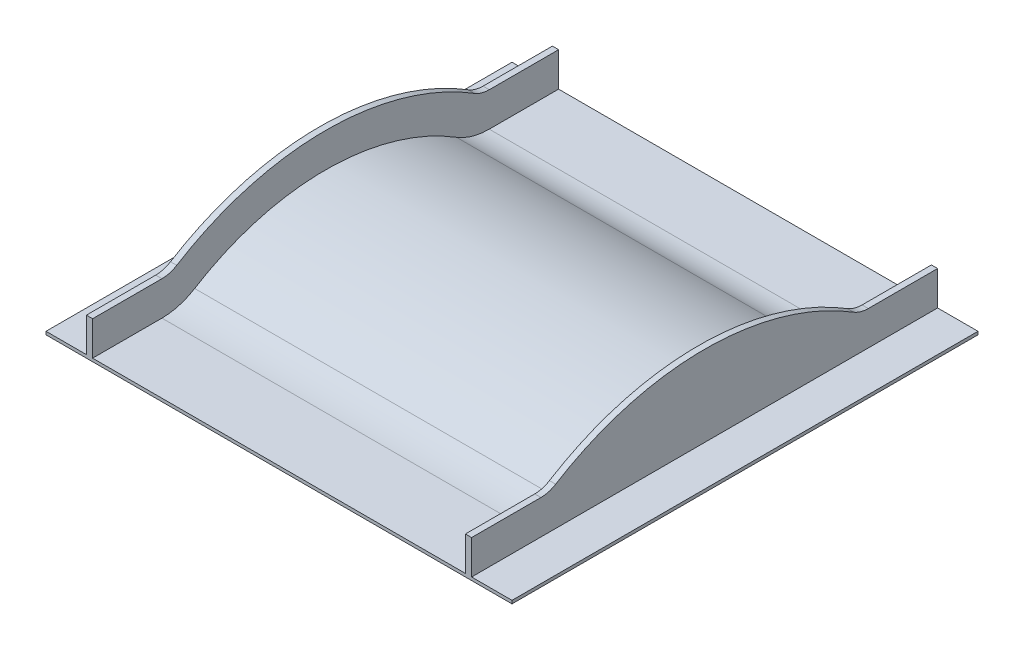
ISO-10303-21;
HEADER;
FILE_DESCRIPTION(('STEP AP214'),'2;1');
FILE_NAME('part.step','',(''),(''),'','','');
FILE_SCHEMA(('AUTOMOTIVE_DESIGN { 1 0 10303 214 1 1 1 1 }'));
ENDSEC;
DATA;
#1=APPLICATION_CONTEXT('core data for automotive mechanical design processes');
#2=APPLICATION_PROTOCOL_DEFINITION('international standard','automotive_design',2000,#1);
#3=PRODUCT_CONTEXT('',#1,'mechanical');
#4=PRODUCT('Part','Part','',(#3));
#5=PRODUCT_RELATED_PRODUCT_CATEGORY('part','',(#4));
#6=PRODUCT_DEFINITION_FORMATION('','',#4);
#7=PRODUCT_DEFINITION_CONTEXT('part definition',#1,'design');
#8=PRODUCT_DEFINITION('design','',#6,#7);
#9=PRODUCT_DEFINITION_SHAPE('','',#8);
#10=(LENGTH_UNIT() NAMED_UNIT(*) SI_UNIT(.MILLI.,.METRE.));
#11=(NAMED_UNIT(*) PLANE_ANGLE_UNIT() SI_UNIT($,.RADIAN.));
#12=(NAMED_UNIT(*) SI_UNIT($,.STERADIAN.) SOLID_ANGLE_UNIT());
#13=UNCERTAINTY_MEASURE_WITH_UNIT(LENGTH_MEASURE(1.E-05),#10,'distance_accuracy_value','');
#14=(GEOMETRIC_REPRESENTATION_CONTEXT(3) GLOBAL_UNCERTAINTY_ASSIGNED_CONTEXT((#13)) GLOBAL_UNIT_ASSIGNED_CONTEXT((#10,
#11,#12)) REPRESENTATION_CONTEXT('',''));
#15=CARTESIAN_POINT('',(0.,0.,0.));
#16=DIRECTION('',(0.,0.,1.));
#17=DIRECTION('',(1.,0.,0.));
#18=AXIS2_PLACEMENT_3D('',#15,#16,#17);
#19=CARTESIAN_POINT('',(0.,10.,0.));
#20=DIRECTION('',(0.,1.,0.));
#21=DIRECTION('',(0.,0.,1.));
#22=AXIS2_PLACEMENT_3D('',#19,#20,#21);
#23=PLANE('',#22);
#24=DIRECTION('',(1.,0.,0.));
#25=VECTOR('',#24,1.);
#26=CARTESIAN_POINT('',(-750.,10.,750.));
#27=LINE('',#26,#25);
#28=CARTESIAN_POINT('',(-600.,10.,750.));
#29=VERTEX_POINT('',#28);
#30=CARTESIAN_POINT('',(600.,10.,750.));
#31=VERTEX_POINT('',#30);
#32=EDGE_CURVE('E367',#29,#31,#27,.T.);
#33=ORIENTED_EDGE('',*,*,#32,.T.);
#34=DIRECTION('',(0.,0.,1.));
#35=VECTOR('',#34,1.);
#36=CARTESIAN_POINT('',(600.,10.,1.1470400727364E-13));
#37=LINE('',#36,#35);
#38=CARTESIAN_POINT('',(600.,10.,526.782687642637));
#39=VERTEX_POINT('',#38);
#40=EDGE_CURVE('E55',#39,#31,#37,.T.);
#41=ORIENTED_EDGE('',*,*,#40,.F.);
#42=DIRECTION('',(-1.,0.,0.));
#43=VECTOR('',#42,1.);
#44=CARTESIAN_POINT('',(1814.18983268964,10.,526.782687642637));
#45=LINE('',#44,#43);
#46=CARTESIAN_POINT('',(-600.,10.,526.782687642637));
#47=VERTEX_POINT('',#46);
#48=EDGE_CURVE('E345',#39,#47,#45,.T.);
#49=ORIENTED_EDGE('',*,*,#48,.T.);
#50=DIRECTION('',(0.,0.,1.));
#51=VECTOR('',#50,1.);
#52=CARTESIAN_POINT('',(-600.,10.,1.1470400727364E-13));
#53=LINE('',#52,#51);
#54=EDGE_CURVE('E290',#47,#29,#53,.T.);
#55=ORIENTED_EDGE('',*,*,#54,.T.);
#56=EDGE_LOOP('',(#33,#41,#49,#55));
#57=FACE_BOUND('',#56,.T.);
#58=ADVANCED_FACE('F40',(#57),#23,.T.);
#59=DIRECTION('',(-1.,0.,0.));
#60=VECTOR('',#59,1.);
#61=CARTESIAN_POINT('',(1814.18983268964,10.0000000000014,-526.782687642637));
#62=LINE('',#61,#60);
#63=CARTESIAN_POINT('',(600.,10.0000000000014,-526.782687642637));
#64=VERTEX_POINT('',#63);
#65=CARTESIAN_POINT('',(-600.,10.,-526.782687642636));
#66=VERTEX_POINT('',#65);
#67=EDGE_CURVE('E343',#64,#66,#62,.T.);
#68=ORIENTED_EDGE('',*,*,#67,.F.);
#69=DIRECTION('',(0.,0.,1.));
#70=VECTOR('',#69,1.);
#71=CARTESIAN_POINT('',(600.,10.,1.1470400727364E-13));
#72=LINE('',#71,#70);
#73=CARTESIAN_POINT('',(600.,10.,-750.));
#74=VERTEX_POINT('',#73);
#75=EDGE_CURVE('E222',#74,#64,#72,.T.);
#76=ORIENTED_EDGE('',*,*,#75,.F.);
#77=DIRECTION('',(-1.,0.,0.));
#78=VECTOR('',#77,1.);
#79=CARTESIAN_POINT('',(-750.,10.,-750.));
#80=LINE('',#79,#78);
#81=CARTESIAN_POINT('',(-600.,10.,-750.));
#82=VERTEX_POINT('',#81);
#83=EDGE_CURVE('E219',#74,#82,#80,.T.);
#84=ORIENTED_EDGE('',*,*,#83,.T.);
#85=DIRECTION('',(0.,0.,1.));
#86=VECTOR('',#85,1.);
#87=CARTESIAN_POINT('',(-600.,10.,1.1470400727364E-13));
#88=LINE('',#87,#86);
#89=EDGE_CURVE('E277',#82,#66,#88,.T.);
#90=ORIENTED_EDGE('',*,*,#89,.T.);
#91=EDGE_LOOP('',(#68,#76,#84,#90));
#92=FACE_BOUND('',#91,.T.);
#93=ADVANCED_FACE('F440',(#92),#23,.T.);
#94=CARTESIAN_POINT('',(1814.18983268964,210.,526.782687642637));
#95=DIRECTION('',(-1.,0.,0.));
#96=DIRECTION('',(0.,0.,1.));
#97=AXIS2_PLACEMENT_3D('',#94,#95,#96);
#98=CYLINDRICAL_SURFACE('',#97,200.);
#99=CARTESIAN_POINT('',(600.,210.,526.782687642637));
#100=DIRECTION('',(-1.,0.,0.));
#101=DIRECTION('',(0.,0.,1.));
#102=AXIS2_PLACEMENT_3D('',#99,#100,#101);
#103=CIRCLE('',#102,200.);
#104=CARTESIAN_POINT('',(600.,40.0000000000001,421.426150114109));
#105=VERTEX_POINT('',#104);
#106=EDGE_CURVE('E62',#105,#39,#103,.T.);
#107=ORIENTED_EDGE('',*,*,#106,.F.);
#108=DIRECTION('',(-1.,0.,0.));
#109=VECTOR('',#108,1.);
#110=CARTESIAN_POINT('',(1814.18983268964,40.0000000000001,421.426150114109));
#111=LINE('',#110,#109);
#112=CARTESIAN_POINT('',(-600.,40.,421.42615011411));
#113=VERTEX_POINT('',#112);
#114=EDGE_CURVE('E349',#105,#113,#111,.T.);
#115=ORIENTED_EDGE('',*,*,#114,.T.);
#116=CARTESIAN_POINT('',(-600.,210.,526.782687642637));
#117=DIRECTION('',(-1.,0.,0.));
#118=DIRECTION('',(0.,0.,1.));
#119=AXIS2_PLACEMENT_3D('',#116,#117,#118);
#120=CIRCLE('',#119,200.);
#121=EDGE_CURVE('E287',#113,#47,#120,.T.);
#122=ORIENTED_EDGE('',*,*,#121,.T.);
#123=ORIENTED_EDGE('',*,*,#48,.F.);
#124=EDGE_LOOP('',(#107,#115,#122,#123));
#125=FACE_BOUND('',#124,.T.);
#126=ADVANCED_FACE('F446',(#125),#98,.F.);
#127=CARTESIAN_POINT('',(1814.18983268964,-640.,-2.68554043105719E-13));
#128=DIRECTION('',(-1.,0.,0.));
#129=DIRECTION('',(0.,0.,1.));
#130=AXIS2_PLACEMENT_3D('',#127,#128,#129);
#131=CYLINDRICAL_SURFACE('',#130,800.);
#132=ORIENTED_EDGE('',*,*,#114,.F.);
#133=CARTESIAN_POINT('',(600.,-640.,0.));
#134=DIRECTION('',(-1.,0.,0.));
#135=DIRECTION('',(0.,0.,1.));
#136=AXIS2_PLACEMENT_3D('',#133,#134,#135);
#137=CIRCLE('',#136,800.);
#138=CARTESIAN_POINT('',(600.,40.0000000000005,-421.426150114109));
#139=VERTEX_POINT('',#138);
#140=EDGE_CURVE('E245',#105,#139,#137,.T.);
#141=ORIENTED_EDGE('',*,*,#140,.T.);
#142=DIRECTION('',(-1.,0.,0.));
#143=VECTOR('',#142,1.);
#144=CARTESIAN_POINT('',(1814.18983268964,40.0000000000005,-421.426150114109));
#145=LINE('',#144,#143);
#146=CARTESIAN_POINT('',(-600.,40.0000000000006,-421.426150114109));
#147=VERTEX_POINT('',#146);
#148=EDGE_CURVE('E347',#139,#147,#145,.T.);
#149=ORIENTED_EDGE('',*,*,#148,.T.);
#150=CARTESIAN_POINT('',(-600.,-640.,0.));
#151=DIRECTION('',(-1.,0.,0.));
#152=DIRECTION('',(0.,0.,1.));
#153=AXIS2_PLACEMENT_3D('',#150,#151,#152);
#154=CIRCLE('',#153,800.);
#155=EDGE_CURVE('E284',#113,#147,#154,.T.);
#156=ORIENTED_EDGE('',*,*,#155,.F.);
#157=EDGE_LOOP('',(#132,#141,#149,#156));
#158=FACE_BOUND('',#157,.T.);
#159=ADVANCED_FACE('F463',(#158),#131,.T.);
#160=CARTESIAN_POINT('',(1814.18983268964,210.000000000002,-526.782687642637));
#161=DIRECTION('',(-1.,0.,0.));
#162=DIRECTION('',(0.,0.,1.));
#163=AXIS2_PLACEMENT_3D('',#160,#161,#162);
#164=CYLINDRICAL_SURFACE('',#163,200.);
#165=ORIENTED_EDGE('',*,*,#148,.F.);
#166=CARTESIAN_POINT('',(600.,210.000000000002,-526.782687642636));
#167=DIRECTION('',(-1.,0.,0.));
#168=DIRECTION('',(0.,0.,1.));
#169=AXIS2_PLACEMENT_3D('',#166,#167,#168);
#170=CIRCLE('',#169,200.000000000001);
#171=EDGE_CURVE('E212',#64,#139,#170,.T.);
#172=ORIENTED_EDGE('',*,*,#171,.F.);
#173=ORIENTED_EDGE('',*,*,#67,.T.);
#174=CARTESIAN_POINT('',(-600.,210.000000000002,-526.782687642636));
#175=DIRECTION('',(-1.,0.,0.));
#176=DIRECTION('',(0.,0.,1.));
#177=AXIS2_PLACEMENT_3D('',#174,#175,#176);
#178=CIRCLE('',#177,200.000000000001);
#179=EDGE_CURVE('E280',#66,#147,#178,.T.);
#180=ORIENTED_EDGE('',*,*,#179,.T.);
#181=EDGE_LOOP('',(#165,#172,#173,#180));
#182=FACE_BOUND('',#181,.T.);
#183=ADVANCED_FACE('F458',(#182),#164,.F.);
#184=DIRECTION('',(0.,0.,-1.));
#185=VECTOR('',#184,1.);
#186=CARTESIAN_POINT('',(620.,10.0000000000007,0.));
#187=LINE('',#186,#185);
#188=CARTESIAN_POINT('',(620.,10.,750.));
#189=VERTEX_POINT('',#188);
#190=CARTESIAN_POINT('',(620.,10.,-750.));
#191=VERTEX_POINT('',#190);
#192=EDGE_CURVE('E340',#189,#191,#187,.T.);
#193=ORIENTED_EDGE('',*,*,#192,.F.);
#194=CARTESIAN_POINT('',(750.,10.,750.));
#195=VERTEX_POINT('',#194);
#196=EDGE_CURVE('E362',#189,#195,#27,.T.);
#197=ORIENTED_EDGE('',*,*,#196,.T.);
#198=DIRECTION('',(0.,0.,-1.));
#199=VECTOR('',#198,1.);
#200=CARTESIAN_POINT('',(750.,10.,-750.));
#201=LINE('',#200,#199);
#202=CARTESIAN_POINT('',(750.,10.,-750.));
#203=VERTEX_POINT('',#202);
#204=EDGE_CURVE('E352',#195,#203,#201,.T.);
#205=ORIENTED_EDGE('',*,*,#204,.T.);
#206=EDGE_CURVE('E357',#203,#191,#80,.T.);
#207=ORIENTED_EDGE('',*,*,#206,.T.);
#208=EDGE_LOOP('',(#193,#197,#205,#207));
#209=FACE_BOUND('',#208,.T.);
#210=ADVANCED_FACE('F400',(#209),#23,.T.);
#211=CARTESIAN_POINT('',(750.,10.,-750.));
#212=DIRECTION('',(-1.,0.,0.));
#213=DIRECTION('',(0.,0.,1.));
#214=AXIS2_PLACEMENT_3D('',#211,#212,#213);
#215=PLANE('',#214);
#216=DIRECTION('',(0.,0.,-1.));
#217=VECTOR('',#216,1.);
#218=CARTESIAN_POINT('',(750.,0.,-750.));
#219=LINE('',#218,#217);
#220=CARTESIAN_POINT('',(750.,0.,750.));
#221=VERTEX_POINT('',#220);
#222=CARTESIAN_POINT('',(750.,0.,-750.));
#223=VERTEX_POINT('',#222);
#224=EDGE_CURVE('E342',#221,#223,#219,.T.);
#225=ORIENTED_EDGE('',*,*,#224,.T.);
#226=DIRECTION('',(0.,-1.,0.));
#227=VECTOR('',#226,1.);
#228=CARTESIAN_POINT('',(750.,10.,-750.));
#229=LINE('',#228,#227);
#230=EDGE_CURVE('E12',#203,#223,#229,.T.);
#231=ORIENTED_EDGE('',*,*,#230,.F.);
#232=ORIENTED_EDGE('',*,*,#204,.F.);
#233=DIRECTION('',(0.,-1.,0.));
#234=VECTOR('',#233,1.);
#235=CARTESIAN_POINT('',(750.,10.,750.));
#236=LINE('',#235,#234);
#237=EDGE_CURVE('E366',#195,#221,#236,.T.);
#238=ORIENTED_EDGE('',*,*,#237,.T.);
#239=EDGE_LOOP('',(#225,#231,#232,#238));
#240=FACE_BOUND('',#239,.T.);
#241=ADVANCED_FACE('F42',(#240),#215,.F.);
#242=CARTESIAN_POINT('',(-750.,10.,-750.));
#243=DIRECTION('',(0.,0.,1.));
#244=DIRECTION('',(1.,0.,0.));
#245=AXIS2_PLACEMENT_3D('',#242,#243,#244);
#246=PLANE('',#245);
#247=DIRECTION('',(-1.,0.,0.));
#248=VECTOR('',#247,1.);
#249=CARTESIAN_POINT('',(-750.,0.,-750.));
#250=LINE('',#249,#248);
#251=CARTESIAN_POINT('',(-750.,0.,-750.));
#252=VERTEX_POINT('',#251);
#253=EDGE_CURVE('E370',#223,#252,#250,.T.);
#254=ORIENTED_EDGE('',*,*,#253,.T.);
#255=DIRECTION('',(0.,-1.,0.));
#256=VECTOR('',#255,1.);
#257=CARTESIAN_POINT('',(-750.,10.,-750.));
#258=LINE('',#257,#256);
#259=CARTESIAN_POINT('',(-750.,10.,-750.));
#260=VERTEX_POINT('',#259);
#261=EDGE_CURVE('E48',#260,#252,#258,.T.);
#262=ORIENTED_EDGE('',*,*,#261,.F.);
#263=CARTESIAN_POINT('',(-620.,10.,-750.));
#264=VERTEX_POINT('',#263);
#265=EDGE_CURVE('E355',#264,#260,#80,.T.);
#266=ORIENTED_EDGE('',*,*,#265,.F.);
#267=DIRECTION('',(0.,-1.,0.));
#268=VECTOR('',#267,1.);
#269=CARTESIAN_POINT('',(-620.,0.,-750.));
#270=LINE('',#269,#268);
#271=CARTESIAN_POINT('',(-620.,120.,-750.));
#272=VERTEX_POINT('',#271);
#273=EDGE_CURVE('E281',#272,#264,#270,.T.);
#274=ORIENTED_EDGE('',*,*,#273,.F.);
#275=DIRECTION('',(-1.,0.,0.));
#276=VECTOR('',#275,1.);
#277=CARTESIAN_POINT('',(-600.,120.,-750.));
#278=LINE('',#277,#276);
#279=CARTESIAN_POINT('',(-600.,120.,-750.));
#280=VERTEX_POINT('',#279);
#281=EDGE_CURVE('E325',#280,#272,#278,.T.);
#282=ORIENTED_EDGE('',*,*,#281,.F.);
#283=DIRECTION('',(0.,-1.,0.));
#284=VECTOR('',#283,1.);
#285=CARTESIAN_POINT('',(-600.,0.,-750.));
#286=LINE('',#285,#284);
#287=EDGE_CURVE('E306',#280,#82,#286,.T.);
#288=ORIENTED_EDGE('',*,*,#287,.T.);
#289=ORIENTED_EDGE('',*,*,#83,.F.);
#290=DIRECTION('',(0.,-1.,0.));
#291=VECTOR('',#290,1.);
#292=CARTESIAN_POINT('',(600.,0.,-750.));
#293=LINE('',#292,#291);
#294=CARTESIAN_POINT('',(600.,120.,-750.));
#295=VERTEX_POINT('',#294);
#296=EDGE_CURVE('E216',#295,#74,#293,.T.);
#297=ORIENTED_EDGE('',*,*,#296,.F.);
#298=DIRECTION('',(1.,0.,0.));
#299=VECTOR('',#298,1.);
#300=CARTESIAN_POINT('',(600.,120.,-750.));
#301=LINE('',#300,#299);
#302=CARTESIAN_POINT('',(620.,120.,-750.));
#303=VERTEX_POINT('',#302);
#304=EDGE_CURVE('E201',#295,#303,#301,.T.);
#305=ORIENTED_EDGE('',*,*,#304,.T.);
#306=DIRECTION('',(0.,-1.,0.));
#307=VECTOR('',#306,1.);
#308=CARTESIAN_POINT('',(620.,0.,-750.));
#309=LINE('',#308,#307);
#310=EDGE_CURVE('E249',#303,#191,#309,.T.);
#311=ORIENTED_EDGE('',*,*,#310,.T.);
#312=ORIENTED_EDGE('',*,*,#206,.F.);
#313=ORIENTED_EDGE('',*,*,#230,.T.);
#314=EDGE_LOOP('',(#254,#262,#266,#274,#282,#288,#289,#297,#305,#311,#312,#313));
#315=FACE_BOUND('',#314,.T.);
#316=ADVANCED_FACE('F217',(#315),#246,.F.);
#317=CARTESIAN_POINT('',(-750.,10.,-750.));
#318=DIRECTION('',(1.,0.,0.));
#319=DIRECTION('',(0.,0.,-1.));
#320=AXIS2_PLACEMENT_3D('',#317,#318,#319);
#321=PLANE('',#320);
#322=DIRECTION('',(0.,0.,1.));
#323=VECTOR('',#322,1.);
#324=CARTESIAN_POINT('',(-750.,0.,-750.));
#325=LINE('',#324,#323);
#326=CARTESIAN_POINT('',(-750.,0.,750.));
#327=VERTEX_POINT('',#326);
#328=EDGE_CURVE('E372',#252,#327,#325,.T.);
#329=ORIENTED_EDGE('',*,*,#328,.T.);
#330=DIRECTION('',(0.,-1.,0.));
#331=VECTOR('',#330,1.);
#332=CARTESIAN_POINT('',(-750.,10.,750.));
#333=LINE('',#332,#331);
#334=CARTESIAN_POINT('',(-750.,10.,750.));
#335=VERTEX_POINT('',#334);
#336=EDGE_CURVE('E377',#335,#327,#333,.T.);
#337=ORIENTED_EDGE('',*,*,#336,.F.);
#338=DIRECTION('',(0.,0.,1.));
#339=VECTOR('',#338,1.);
#340=CARTESIAN_POINT('',(-750.,10.,-750.));
#341=LINE('',#340,#339);
#342=EDGE_CURVE('E360',#260,#335,#341,.T.);
#343=ORIENTED_EDGE('',*,*,#342,.F.);
#344=ORIENTED_EDGE('',*,*,#261,.T.);
#345=EDGE_LOOP('',(#329,#337,#343,#344));
#346=FACE_BOUND('',#345,.T.);
#347=ADVANCED_FACE('F384',(#346),#321,.F.);
#348=CARTESIAN_POINT('',(-750.,10.,750.));
#349=DIRECTION('',(0.,0.,-1.));
#350=DIRECTION('',(-1.,0.,0.));
#351=AXIS2_PLACEMENT_3D('',#348,#349,#350);
#352=PLANE('',#351);
#353=DIRECTION('',(1.,0.,0.));
#354=VECTOR('',#353,1.);
#355=CARTESIAN_POINT('',(-750.,0.,750.));
#356=LINE('',#355,#354);
#357=EDGE_CURVE('E356',#327,#221,#356,.T.);
#358=ORIENTED_EDGE('',*,*,#357,.T.);
#359=ORIENTED_EDGE('',*,*,#237,.F.);
#360=ORIENTED_EDGE('',*,*,#196,.F.);
#361=DIRECTION('',(0.,-1.,0.));
#362=VECTOR('',#361,1.);
#363=CARTESIAN_POINT('',(620.,0.,750.));
#364=LINE('',#363,#362);
#365=CARTESIAN_POINT('',(620.,120.,750.));
#366=VERTEX_POINT('',#365);
#367=EDGE_CURVE('E264',#366,#189,#364,.T.);
#368=ORIENTED_EDGE('',*,*,#367,.F.);
#369=DIRECTION('',(1.,0.,0.));
#370=VECTOR('',#369,1.);
#371=CARTESIAN_POINT('',(600.,120.,750.));
#372=LINE('',#371,#370);
#373=CARTESIAN_POINT('',(600.,120.,750.));
#374=VERTEX_POINT('',#373);
#375=EDGE_CURVE('E267',#374,#366,#372,.T.);
#376=ORIENTED_EDGE('',*,*,#375,.F.);
#377=DIRECTION('',(0.,-1.,0.));
#378=VECTOR('',#377,1.);
#379=CARTESIAN_POINT('',(600.,0.,750.));
#380=LINE('',#379,#378);
#381=EDGE_CURVE('E240',#374,#31,#380,.T.);
#382=ORIENTED_EDGE('',*,*,#381,.T.);
#383=ORIENTED_EDGE('',*,*,#32,.F.);
#384=DIRECTION('',(0.,-1.,0.));
#385=VECTOR('',#384,1.);
#386=CARTESIAN_POINT('',(-600.,0.,750.));
#387=LINE('',#386,#385);
#388=CARTESIAN_POINT('',(-600.,120.,750.));
#389=VERTEX_POINT('',#388);
#390=EDGE_CURVE('E293',#389,#29,#387,.T.);
#391=ORIENTED_EDGE('',*,*,#390,.F.);
#392=DIRECTION('',(-1.,0.,0.));
#393=VECTOR('',#392,1.);
#394=CARTESIAN_POINT('',(-600.,120.,750.));
#395=LINE('',#394,#393);
#396=CARTESIAN_POINT('',(-620.,120.,750.));
#397=VERTEX_POINT('',#396);
#398=EDGE_CURVE('E308',#389,#397,#395,.T.);
#399=ORIENTED_EDGE('',*,*,#398,.T.);
#400=DIRECTION('',(0.,-1.,0.));
#401=VECTOR('',#400,1.);
#402=CARTESIAN_POINT('',(-620.,0.,750.));
#403=LINE('',#402,#401);
#404=CARTESIAN_POINT('',(-620.,10.,750.));
#405=VERTEX_POINT('',#404);
#406=EDGE_CURVE('E269',#397,#405,#403,.T.);
#407=ORIENTED_EDGE('',*,*,#406,.T.);
#408=EDGE_CURVE('E363',#335,#405,#27,.T.);
#409=ORIENTED_EDGE('',*,*,#408,.F.);
#410=ORIENTED_EDGE('',*,*,#336,.T.);
#411=EDGE_LOOP('',(#358,#359,#360,#368,#376,#382,#383,#391,#399,#407,#409,#410));
#412=FACE_BOUND('',#411,.T.);
#413=ADVANCED_FACE('F393',(#412),#352,.F.);
#414=DIRECTION('',(0.,0.,1.));
#415=VECTOR('',#414,1.);
#416=CARTESIAN_POINT('',(-620.,10.0000000000007,1.2114671162412E-13));
#417=LINE('',#416,#415);
#418=EDGE_CURVE('E327',#264,#405,#417,.T.);
#419=ORIENTED_EDGE('',*,*,#418,.F.);
#420=ORIENTED_EDGE('',*,*,#265,.T.);
#421=ORIENTED_EDGE('',*,*,#342,.T.);
#422=ORIENTED_EDGE('',*,*,#408,.T.);
#423=EDGE_LOOP('',(#419,#420,#421,#422));
#424=FACE_BOUND('',#423,.T.);
#425=ADVANCED_FACE('F442',(#424),#23,.T.);
#426=CARTESIAN_POINT('',(0.,0.,0.));
#427=DIRECTION('',(0.,1.,0.));
#428=DIRECTION('',(0.,0.,1.));
#429=AXIS2_PLACEMENT_3D('',#426,#427,#428);
#430=PLANE('',#429);
#431=ORIENTED_EDGE('',*,*,#224,.F.);
#432=ORIENTED_EDGE('',*,*,#357,.F.);
#433=ORIENTED_EDGE('',*,*,#328,.F.);
#434=ORIENTED_EDGE('',*,*,#253,.F.);
#435=EDGE_LOOP('',(#431,#432,#433,#434));
#436=FACE_BOUND('',#435,.T.);
#437=ADVANCED_FACE('F390',(#436),#430,.F.);
#438=CARTESIAN_POINT('',(-620.,0.,1.07974498362975E-13));
#439=DIRECTION('',(-1.,0.,0.));
#440=DIRECTION('',(0.,0.,1.));
#441=AXIS2_PLACEMENT_3D('',#438,#439,#440);
#442=PLANE('',#441);
#443=ORIENTED_EDGE('',*,*,#418,.T.);
#444=ORIENTED_EDGE('',*,*,#406,.F.);
#445=DIRECTION('',(0.,0.,1.));
#446=VECTOR('',#445,1.);
#447=CARTESIAN_POINT('',(-620.,120.,1.17664602005974E-13));
#448=LINE('',#447,#446);
#449=CARTESIAN_POINT('',(-620.,120.,526.782687642637));
#450=VERTEX_POINT('',#449);
#451=EDGE_CURVE('E311',#450,#397,#448,.T.);
#452=ORIENTED_EDGE('',*,*,#451,.F.);
#453=CARTESIAN_POINT('',(-620.,210.,526.782687642637));
#454=DIRECTION('',(-1.,0.,0.));
#455=DIRECTION('',(0.,0.,1.));
#456=AXIS2_PLACEMENT_3D('',#453,#454,#455);
#457=CIRCLE('',#456,90.);
#458=CARTESIAN_POINT('',(-620.,133.5,479.3722457548));
#459=VERTEX_POINT('',#458);
#460=EDGE_CURVE('E313',#459,#450,#457,.T.);
#461=ORIENTED_EDGE('',*,*,#460,.F.);
#462=CARTESIAN_POINT('',(-620.,-640.,0.));
#463=DIRECTION('',(-1.,0.,0.));
#464=DIRECTION('',(0.,0.,1.));
#465=AXIS2_PLACEMENT_3D('',#462,#463,#464);
#466=CIRCLE('',#465,910.);
#467=CARTESIAN_POINT('',(-620.,133.5,-479.372245754799));
#468=VERTEX_POINT('',#467);
#469=EDGE_CURVE('E315',#459,#468,#466,.T.);
#470=ORIENTED_EDGE('',*,*,#469,.T.);
#471=CARTESIAN_POINT('',(-620.,210.000000000002,-526.782687642636));
#472=DIRECTION('',(-1.,0.,0.));
#473=DIRECTION('',(0.,0.,1.));
#474=AXIS2_PLACEMENT_3D('',#471,#472,#473);
#475=CIRCLE('',#474,90.0000000000014);
#476=CARTESIAN_POINT('',(-620.,120.,-526.782687642636));
#477=VERTEX_POINT('',#476);
#478=EDGE_CURVE('E318',#477,#468,#475,.T.);
#479=ORIENTED_EDGE('',*,*,#478,.F.);
#480=DIRECTION('',(0.,0.,1.));
#481=VECTOR('',#480,1.);
#482=CARTESIAN_POINT('',(-620.,120.,1.17664602005974E-13));
#483=LINE('',#482,#481);
#484=EDGE_CURVE('E321',#272,#477,#483,.T.);
#485=ORIENTED_EDGE('',*,*,#484,.F.);
#486=ORIENTED_EDGE('',*,*,#273,.T.);
#487=EDGE_LOOP('',(#443,#444,#452,#461,#470,#479,#485,#486));
#488=FACE_BOUND('',#487,.T.);
#489=ADVANCED_FACE('F427',(#488),#442,.T.);
#490=CARTESIAN_POINT('',(620.,10.,-750.));
#491=DIRECTION('',(-1.,0.,0.));
#492=DIRECTION('',(0.,0.,1.));
#493=AXIS2_PLACEMENT_3D('',#490,#491,#492);
#494=PLANE('',#493);
#495=ORIENTED_EDGE('',*,*,#192,.T.);
#496=ORIENTED_EDGE('',*,*,#310,.F.);
#497=DIRECTION('',(0.,0.,1.));
#498=VECTOR('',#497,1.);
#499=CARTESIAN_POINT('',(620.,120.,1.17664602005974E-13));
#500=LINE('',#499,#498);
#501=CARTESIAN_POINT('',(620.,120.,-526.782687642636));
#502=VERTEX_POINT('',#501);
#503=EDGE_CURVE('E207',#303,#502,#500,.T.);
#504=ORIENTED_EDGE('',*,*,#503,.T.);
#505=CARTESIAN_POINT('',(620.,210.000000000002,-526.782687642636));
#506=DIRECTION('',(-1.,0.,0.));
#507=DIRECTION('',(0.,0.,1.));
#508=AXIS2_PLACEMENT_3D('',#505,#506,#507);
#509=CIRCLE('',#508,90.0000000000014);
#510=CARTESIAN_POINT('',(620.,133.5,-479.372245754799));
#511=VERTEX_POINT('',#510);
#512=EDGE_CURVE('E252',#502,#511,#509,.T.);
#513=ORIENTED_EDGE('',*,*,#512,.T.);
#514=CARTESIAN_POINT('',(620.,-640.,0.));
#515=DIRECTION('',(-1.,0.,0.));
#516=DIRECTION('',(0.,0.,1.));
#517=AXIS2_PLACEMENT_3D('',#514,#515,#516);
#518=CIRCLE('',#517,910.);
#519=CARTESIAN_POINT('',(620.,133.5,479.3722457548));
#520=VERTEX_POINT('',#519);
#521=EDGE_CURVE('E255',#520,#511,#518,.T.);
#522=ORIENTED_EDGE('',*,*,#521,.F.);
#523=CARTESIAN_POINT('',(620.,210.,526.782687642637));
#524=DIRECTION('',(-1.,0.,0.));
#525=DIRECTION('',(0.,0.,1.));
#526=AXIS2_PLACEMENT_3D('',#523,#524,#525);
#527=CIRCLE('',#526,90.);
#528=CARTESIAN_POINT('',(620.,120.,526.782687642637));
#529=VERTEX_POINT('',#528);
#530=EDGE_CURVE('E258',#520,#529,#527,.T.);
#531=ORIENTED_EDGE('',*,*,#530,.T.);
#532=DIRECTION('',(0.,0.,1.));
#533=VECTOR('',#532,1.);
#534=CARTESIAN_POINT('',(620.,120.,1.17664602005974E-13));
#535=LINE('',#534,#533);
#536=EDGE_CURVE('E261',#529,#366,#535,.T.);
#537=ORIENTED_EDGE('',*,*,#536,.T.);
#538=ORIENTED_EDGE('',*,*,#367,.T.);
#539=EDGE_LOOP('',(#495,#496,#504,#513,#522,#531,#537,#538));
#540=FACE_BOUND('',#539,.T.);
#541=ADVANCED_FACE('F424',(#540),#494,.F.);
#542=CARTESIAN_POINT('',(-600.,120.,1.1470400727364E-13));
#543=DIRECTION('',(0.,-1.,0.));
#544=DIRECTION('',(0.,0.,-1.));
#545=AXIS2_PLACEMENT_3D('',#542,#543,#544);
#546=PLANE('',#545);
#547=ORIENTED_EDGE('',*,*,#484,.T.);
#548=DIRECTION('',(-1.,0.,0.));
#549=VECTOR('',#548,1.);
#550=CARTESIAN_POINT('',(-600.,120.,-526.782687642636));
#551=LINE('',#550,#549);
#552=CARTESIAN_POINT('',(-600.,120.,-526.782687642636));
#553=VERTEX_POINT('',#552);
#554=EDGE_CURVE('E328',#553,#477,#551,.T.);
#555=ORIENTED_EDGE('',*,*,#554,.F.);
#556=DIRECTION('',(0.,0.,1.));
#557=VECTOR('',#556,1.);
#558=CARTESIAN_POINT('',(-600.,120.,1.1470400727364E-13));
#559=LINE('',#558,#557);
#560=EDGE_CURVE('E304',#280,#553,#559,.T.);
#561=ORIENTED_EDGE('',*,*,#560,.F.);
#562=ORIENTED_EDGE('',*,*,#281,.T.);
#563=EDGE_LOOP('',(#547,#555,#561,#562));
#564=FACE_BOUND('',#563,.T.);
#565=ADVANCED_FACE('F426',(#564),#546,.F.);
#566=CARTESIAN_POINT('',(-600.,210.000000000002,-526.782687642636));
#567=DIRECTION('',(-1.,0.,0.));
#568=DIRECTION('',(0.,0.,1.));
#569=AXIS2_PLACEMENT_3D('',#566,#567,#568);
#570=CYLINDRICAL_SURFACE('',#569,90.0000000000014);
#571=ORIENTED_EDGE('',*,*,#478,.T.);
#572=DIRECTION('',(-1.,0.,0.));
#573=VECTOR('',#572,1.);
#574=CARTESIAN_POINT('',(-600.,133.5,-479.372245754799));
#575=LINE('',#574,#573);
#576=CARTESIAN_POINT('',(-600.,133.5,-479.372245754799));
#577=VERTEX_POINT('',#576);
#578=EDGE_CURVE('E331',#577,#468,#575,.T.);
#579=ORIENTED_EDGE('',*,*,#578,.F.);
#580=CARTESIAN_POINT('',(-600.,210.000000000002,-526.782687642636));
#581=DIRECTION('',(-1.,0.,0.));
#582=DIRECTION('',(0.,0.,1.));
#583=AXIS2_PLACEMENT_3D('',#580,#581,#582);
#584=CIRCLE('',#583,90.0000000000014);
#585=EDGE_CURVE('E302',#553,#577,#584,.T.);
#586=ORIENTED_EDGE('',*,*,#585,.F.);
#587=ORIENTED_EDGE('',*,*,#554,.T.);
#588=EDGE_LOOP('',(#571,#579,#586,#587));
#589=FACE_BOUND('',#588,.T.);
#590=ADVANCED_FACE('F433',(#589),#570,.F.);
#591=CARTESIAN_POINT('',(-600.,-640.,0.));
#592=DIRECTION('',(-1.,0.,0.));
#593=DIRECTION('',(0.,0.,1.));
#594=AXIS2_PLACEMENT_3D('',#591,#592,#593);
#595=CYLINDRICAL_SURFACE('',#594,910.);
#596=ORIENTED_EDGE('',*,*,#469,.F.);
#597=DIRECTION('',(-1.,0.,0.));
#598=VECTOR('',#597,1.);
#599=CARTESIAN_POINT('',(-600.,133.5,479.3722457548));
#600=LINE('',#599,#598);
#601=CARTESIAN_POINT('',(-600.,133.5,479.3722457548));
#602=VERTEX_POINT('',#601);
#603=EDGE_CURVE('E333',#602,#459,#600,.T.);
#604=ORIENTED_EDGE('',*,*,#603,.F.);
#605=CARTESIAN_POINT('',(-600.,-640.,0.));
#606=DIRECTION('',(-1.,0.,0.));
#607=DIRECTION('',(0.,0.,1.));
#608=AXIS2_PLACEMENT_3D('',#605,#606,#607);
#609=CIRCLE('',#608,910.);
#610=EDGE_CURVE('E299',#602,#577,#609,.T.);
#611=ORIENTED_EDGE('',*,*,#610,.T.);
#612=ORIENTED_EDGE('',*,*,#578,.T.);
#613=EDGE_LOOP('',(#596,#604,#611,#612));
#614=FACE_BOUND('',#613,.T.);
#615=ADVANCED_FACE('F583',(#614),#595,.T.);
#616=CARTESIAN_POINT('',(-600.,210.,526.782687642637));
#617=DIRECTION('',(-1.,0.,0.));
#618=DIRECTION('',(0.,0.,1.));
#619=AXIS2_PLACEMENT_3D('',#616,#617,#618);
#620=CYLINDRICAL_SURFACE('',#619,90.);
#621=ORIENTED_EDGE('',*,*,#460,.T.);
#622=DIRECTION('',(-1.,0.,0.));
#623=VECTOR('',#622,1.);
#624=CARTESIAN_POINT('',(-600.,120.,526.782687642637));
#625=LINE('',#624,#623);
#626=CARTESIAN_POINT('',(-600.,120.,526.782687642637));
#627=VERTEX_POINT('',#626);
#628=EDGE_CURVE('E335',#627,#450,#625,.T.);
#629=ORIENTED_EDGE('',*,*,#628,.F.);
#630=CARTESIAN_POINT('',(-600.,210.,526.782687642637));
#631=DIRECTION('',(-1.,0.,0.));
#632=DIRECTION('',(0.,0.,1.));
#633=AXIS2_PLACEMENT_3D('',#630,#631,#632);
#634=CIRCLE('',#633,90.);
#635=EDGE_CURVE('E297',#602,#627,#634,.T.);
#636=ORIENTED_EDGE('',*,*,#635,.F.);
#637=ORIENTED_EDGE('',*,*,#603,.T.);
#638=EDGE_LOOP('',(#621,#629,#636,#637));
#639=FACE_BOUND('',#638,.T.);
#640=ADVANCED_FACE('F587',(#639),#620,.F.);
#641=CARTESIAN_POINT('',(-600.,120.,1.1470400727364E-13));
#642=DIRECTION('',(0.,-1.,0.));
#643=DIRECTION('',(0.,0.,-1.));
#644=AXIS2_PLACEMENT_3D('',#641,#642,#643);
#645=PLANE('',#644);
#646=ORIENTED_EDGE('',*,*,#451,.T.);
#647=ORIENTED_EDGE('',*,*,#398,.F.);
#648=DIRECTION('',(0.,0.,1.));
#649=VECTOR('',#648,1.);
#650=CARTESIAN_POINT('',(-600.,120.,1.1470400727364E-13));
#651=LINE('',#650,#649);
#652=EDGE_CURVE('E295',#627,#389,#651,.T.);
#653=ORIENTED_EDGE('',*,*,#652,.F.);
#654=ORIENTED_EDGE('',*,*,#628,.T.);
#655=EDGE_LOOP('',(#646,#647,#653,#654));
#656=FACE_BOUND('',#655,.T.);
#657=ADVANCED_FACE('F578',(#656),#645,.F.);
#658=CARTESIAN_POINT('',(-600.,0.,1.1470400727364E-13));
#659=DIRECTION('',(-1.,0.,0.));
#660=DIRECTION('',(0.,0.,1.));
#661=AXIS2_PLACEMENT_3D('',#658,#659,#660);
#662=PLANE('',#661);
#663=ORIENTED_EDGE('',*,*,#89,.F.);
#664=ORIENTED_EDGE('',*,*,#287,.F.);
#665=ORIENTED_EDGE('',*,*,#560,.T.);
#666=ORIENTED_EDGE('',*,*,#585,.T.);
#667=ORIENTED_EDGE('',*,*,#610,.F.);
#668=ORIENTED_EDGE('',*,*,#635,.T.);
#669=ORIENTED_EDGE('',*,*,#652,.T.);
#670=ORIENTED_EDGE('',*,*,#390,.T.);
#671=ORIENTED_EDGE('',*,*,#54,.F.);
#672=ORIENTED_EDGE('',*,*,#121,.F.);
#673=ORIENTED_EDGE('',*,*,#155,.T.);
#674=ORIENTED_EDGE('',*,*,#179,.F.);
#675=EDGE_LOOP('',(#663,#664,#665,#666,#667,#668,#669,#670,#671,#672,#673,#674));
#676=FACE_BOUND('',#675,.T.);
#677=ADVANCED_FACE('F526',(#676),#662,.F.);
#678=CARTESIAN_POINT('',(600.,120.,1.1470400727364E-13));
#679=DIRECTION('',(0.,1.,0.));
#680=DIRECTION('',(0.,0.,1.));
#681=AXIS2_PLACEMENT_3D('',#678,#679,#680);
#682=PLANE('',#681);
#683=ORIENTED_EDGE('',*,*,#536,.F.);
#684=DIRECTION('',(1.,0.,0.));
#685=VECTOR('',#684,1.);
#686=CARTESIAN_POINT('',(600.,120.,526.782687642637));
#687=LINE('',#686,#685);
#688=CARTESIAN_POINT('',(600.,120.,526.782687642637));
#689=VERTEX_POINT('',#688);
#690=EDGE_CURVE('E270',#689,#529,#687,.T.);
#691=ORIENTED_EDGE('',*,*,#690,.F.);
#692=DIRECTION('',(0.,0.,1.));
#693=VECTOR('',#692,1.);
#694=CARTESIAN_POINT('',(600.,120.,1.1470400727364E-13));
#695=LINE('',#694,#693);
#696=EDGE_CURVE('E237',#689,#374,#695,.T.);
#697=ORIENTED_EDGE('',*,*,#696,.T.);
#698=ORIENTED_EDGE('',*,*,#375,.T.);
#699=EDGE_LOOP('',(#683,#691,#697,#698));
#700=FACE_BOUND('',#699,.T.);
#701=ADVANCED_FACE('F410',(#700),#682,.T.);
#702=CARTESIAN_POINT('',(600.,210.,526.782687642637));
#703=DIRECTION('',(1.,0.,0.));
#704=DIRECTION('',(0.,0.,-1.));
#705=AXIS2_PLACEMENT_3D('',#702,#703,#704);
#706=CYLINDRICAL_SURFACE('',#705,90.);
#707=ORIENTED_EDGE('',*,*,#530,.F.);
#708=DIRECTION('',(1.,0.,0.));
#709=VECTOR('',#708,1.);
#710=CARTESIAN_POINT('',(600.,133.5,479.3722457548));
#711=LINE('',#710,#709);
#712=CARTESIAN_POINT('',(600.,133.5,479.3722457548));
#713=VERTEX_POINT('',#712);
#714=EDGE_CURVE('E272',#713,#520,#711,.T.);
#715=ORIENTED_EDGE('',*,*,#714,.F.);
#716=CARTESIAN_POINT('',(600.,210.,526.782687642637));
#717=DIRECTION('',(-1.,0.,0.));
#718=DIRECTION('',(0.,0.,1.));
#719=AXIS2_PLACEMENT_3D('',#716,#717,#718);
#720=CIRCLE('',#719,90.);
#721=EDGE_CURVE('E234',#713,#689,#720,.T.);
#722=ORIENTED_EDGE('',*,*,#721,.T.);
#723=ORIENTED_EDGE('',*,*,#690,.T.);
#724=EDGE_LOOP('',(#707,#715,#722,#723));
#725=FACE_BOUND('',#724,.T.);
#726=ADVANCED_FACE('F414',(#725),#706,.F.);
#727=CARTESIAN_POINT('',(600.,-640.,0.));
#728=DIRECTION('',(1.,0.,0.));
#729=DIRECTION('',(0.,0.,-1.));
#730=AXIS2_PLACEMENT_3D('',#727,#728,#729);
#731=CYLINDRICAL_SURFACE('',#730,910.);
#732=ORIENTED_EDGE('',*,*,#521,.T.);
#733=DIRECTION('',(1.,0.,0.));
#734=VECTOR('',#733,1.);
#735=CARTESIAN_POINT('',(600.,133.5,-479.372245754799));
#736=LINE('',#735,#734);
#737=CARTESIAN_POINT('',(600.,133.5,-479.372245754799));
#738=VERTEX_POINT('',#737);
#739=EDGE_CURVE('E274',#738,#511,#736,.T.);
#740=ORIENTED_EDGE('',*,*,#739,.F.);
#741=CARTESIAN_POINT('',(600.,-640.,0.));
#742=DIRECTION('',(-1.,0.,0.));
#743=DIRECTION('',(0.,0.,1.));
#744=AXIS2_PLACEMENT_3D('',#741,#742,#743);
#745=CIRCLE('',#744,910.);
#746=EDGE_CURVE('E229',#713,#738,#745,.T.);
#747=ORIENTED_EDGE('',*,*,#746,.F.);
#748=ORIENTED_EDGE('',*,*,#714,.T.);
#749=EDGE_LOOP('',(#732,#740,#747,#748));
#750=FACE_BOUND('',#749,.T.);
#751=ADVANCED_FACE('F419',(#750),#731,.T.);
#752=CARTESIAN_POINT('',(600.,210.000000000002,-526.782687642636));
#753=DIRECTION('',(1.,0.,0.));
#754=DIRECTION('',(0.,0.,-1.));
#755=AXIS2_PLACEMENT_3D('',#752,#753,#754);
#756=CYLINDRICAL_SURFACE('',#755,90.0000000000014);
#757=ORIENTED_EDGE('',*,*,#512,.F.);
#758=DIRECTION('',(1.,0.,0.));
#759=VECTOR('',#758,1.);
#760=CARTESIAN_POINT('',(600.,120.,-526.782687642636));
#761=LINE('',#760,#759);
#762=CARTESIAN_POINT('',(600.,120.,-526.782687642636));
#763=VERTEX_POINT('',#762);
#764=EDGE_CURVE('E211',#763,#502,#761,.T.);
#765=ORIENTED_EDGE('',*,*,#764,.F.);
#766=CARTESIAN_POINT('',(600.,210.000000000002,-526.782687642636));
#767=DIRECTION('',(-1.,0.,0.));
#768=DIRECTION('',(0.,0.,1.));
#769=AXIS2_PLACEMENT_3D('',#766,#767,#768);
#770=CIRCLE('',#769,90.0000000000014);
#771=EDGE_CURVE('E227',#763,#738,#770,.T.);
#772=ORIENTED_EDGE('',*,*,#771,.T.);
#773=ORIENTED_EDGE('',*,*,#739,.T.);
#774=EDGE_LOOP('',(#757,#765,#772,#773));
#775=FACE_BOUND('',#774,.T.);
#776=ADVANCED_FACE('F422',(#775),#756,.F.);
#777=CARTESIAN_POINT('',(600.,120.,1.1470400727364E-13));
#778=DIRECTION('',(0.,1.,0.));
#779=DIRECTION('',(0.,0.,1.));
#780=AXIS2_PLACEMENT_3D('',#777,#778,#779);
#781=PLANE('',#780);
#782=ORIENTED_EDGE('',*,*,#503,.F.);
#783=ORIENTED_EDGE('',*,*,#304,.F.);
#784=DIRECTION('',(0.,0.,1.));
#785=VECTOR('',#784,1.);
#786=CARTESIAN_POINT('',(600.,120.,1.1470400727364E-13));
#787=LINE('',#786,#785);
#788=EDGE_CURVE('E205',#295,#763,#787,.T.);
#789=ORIENTED_EDGE('',*,*,#788,.T.);
#790=ORIENTED_EDGE('',*,*,#764,.T.);
#791=EDGE_LOOP('',(#782,#783,#789,#790));
#792=FACE_BOUND('',#791,.T.);
#793=ADVANCED_FACE('F203',(#792),#781,.T.);
#794=CARTESIAN_POINT('',(600.,0.,1.1470400727364E-13));
#795=DIRECTION('',(1.,0.,0.));
#796=DIRECTION('',(0.,0.,1.));
#797=AXIS2_PLACEMENT_3D('',#794,#795,#796);
#798=PLANE('',#797);
#799=ORIENTED_EDGE('',*,*,#75,.T.);
#800=ORIENTED_EDGE('',*,*,#171,.T.);
#801=ORIENTED_EDGE('',*,*,#140,.F.);
#802=ORIENTED_EDGE('',*,*,#106,.T.);
#803=ORIENTED_EDGE('',*,*,#40,.T.);
#804=ORIENTED_EDGE('',*,*,#381,.F.);
#805=ORIENTED_EDGE('',*,*,#696,.F.);
#806=ORIENTED_EDGE('',*,*,#721,.F.);
#807=ORIENTED_EDGE('',*,*,#746,.T.);
#808=ORIENTED_EDGE('',*,*,#771,.F.);
#809=ORIENTED_EDGE('',*,*,#788,.F.);
#810=ORIENTED_EDGE('',*,*,#296,.T.);
#811=EDGE_LOOP('',(#799,#800,#801,#802,#803,#804,#805,#806,#807,#808,#809,#810));
#812=FACE_BOUND('',#811,.T.);
#813=ADVANCED_FACE('F225',(#812),#798,.F.);
#814=CLOSED_SHELL('',(#58,#93,#126,#159,#183,#210,#241,#316,#347,#413,#425,#437,#489,#541,#565,
#590,#615,#640,#657,#677,#701,#726,#751,#776,#793,#813));
#815=MANIFOLD_SOLID_BREP('B2',#814);
#816=ADVANCED_BREP_SHAPE_REPRESENTATION('',(#18,#815),#14);
#817=SHAPE_DEFINITION_REPRESENTATION(#9,#816);
ENDSEC;
END-ISO-10303-21;
